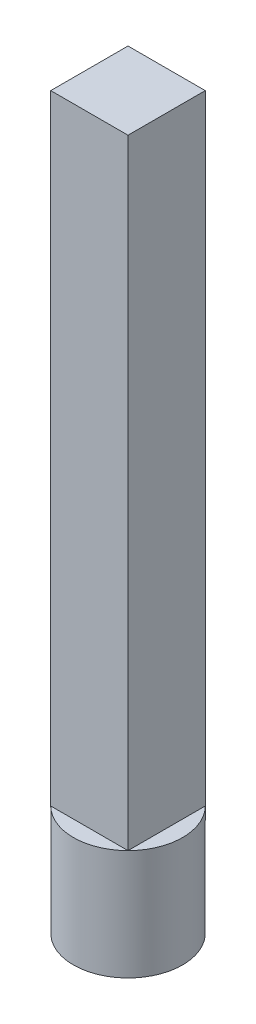
ISO-10303-21;
HEADER;
FILE_DESCRIPTION(('STEP AP214'),'2;1');
FILE_NAME('part.step','',(''),(''),'','','');
FILE_SCHEMA(('AUTOMOTIVE_DESIGN { 1 0 10303 214 1 1 1 1 }'));
ENDSEC;
DATA;
#1=APPLICATION_CONTEXT('core data for automotive mechanical design processes');
#2=APPLICATION_PROTOCOL_DEFINITION('international standard','automotive_design',2000,#1);
#3=PRODUCT_CONTEXT('',#1,'mechanical');
#4=PRODUCT('Part','Part','',(#3));
#5=PRODUCT_RELATED_PRODUCT_CATEGORY('part','',(#4));
#6=PRODUCT_DEFINITION_FORMATION('','',#4);
#7=PRODUCT_DEFINITION_CONTEXT('part definition',#1,'design');
#8=PRODUCT_DEFINITION('design','',#6,#7);
#9=PRODUCT_DEFINITION_SHAPE('','',#8);
#10=(LENGTH_UNIT() NAMED_UNIT(*) SI_UNIT(.MILLI.,.METRE.));
#11=(NAMED_UNIT(*) PLANE_ANGLE_UNIT() SI_UNIT($,.RADIAN.));
#12=(NAMED_UNIT(*) SI_UNIT($,.STERADIAN.) SOLID_ANGLE_UNIT());
#13=UNCERTAINTY_MEASURE_WITH_UNIT(LENGTH_MEASURE(1.E-05),#10,'distance_accuracy_value','');
#14=(GEOMETRIC_REPRESENTATION_CONTEXT(3) GLOBAL_UNCERTAINTY_ASSIGNED_CONTEXT((#13)) GLOBAL_UNIT_ASSIGNED_CONTEXT((#10,
#11,#12)) REPRESENTATION_CONTEXT('',''));
#15=CARTESIAN_POINT('',(0.,0.,0.));
#16=DIRECTION('',(0.,0.,1.));
#17=DIRECTION('',(1.,0.,0.));
#18=AXIS2_PLACEMENT_3D('',#15,#16,#17);
#19=CARTESIAN_POINT('',(0.,160.4,10.));
#20=DIRECTION('',(0.,0.,-1.));
#21=DIRECTION('',(-1.,0.,0.));
#22=AXIS2_PLACEMENT_3D('',#19,#20,#21);
#23=PLANE('',#22);
#24=DIRECTION('',(1.,0.,0.));
#25=VECTOR('',#24,1.);
#26=CARTESIAN_POINT('',(0.,0.,10.));
#27=LINE('',#26,#25);
#28=CARTESIAN_POINT('',(-9.99999999999999,0.,10.));
#29=VERTEX_POINT('',#28);
#30=CARTESIAN_POINT('',(10.,0.,10.));
#31=VERTEX_POINT('',#30);
#32=EDGE_CURVE('E92',#29,#31,#27,.T.);
#33=ORIENTED_EDGE('',*,*,#32,.T.);
#34=DIRECTION('',(0.,-1.,0.));
#35=VECTOR('',#34,1.);
#36=CARTESIAN_POINT('',(10.,160.4,10.));
#37=LINE('',#36,#35);
#38=CARTESIAN_POINT('',(10.,160.4,10.));
#39=VERTEX_POINT('',#38);
#40=EDGE_CURVE('E13',#39,#31,#37,.T.);
#41=ORIENTED_EDGE('',*,*,#40,.F.);
#42=DIRECTION('',(1.,0.,0.));
#43=VECTOR('',#42,1.);
#44=CARTESIAN_POINT('',(0.,160.4,10.));
#45=LINE('',#44,#43);
#46=CARTESIAN_POINT('',(-10.,160.4,10.));
#47=VERTEX_POINT('',#46);
#48=EDGE_CURVE('E124',#47,#39,#45,.T.);
#49=ORIENTED_EDGE('',*,*,#48,.F.);
#50=DIRECTION('',(0.,-1.,0.));
#51=VECTOR('',#50,1.);
#52=CARTESIAN_POINT('',(-10.,160.4,10.));
#53=LINE('',#52,#51);
#54=EDGE_CURVE('E61',#47,#29,#53,.T.);
#55=ORIENTED_EDGE('',*,*,#54,.T.);
#56=EDGE_LOOP('',(#33,#41,#49,#55));
#57=FACE_BOUND('',#56,.T.);
#58=ADVANCED_FACE('F46',(#57),#23,.F.);
#59=CARTESIAN_POINT('',(10.,160.4,0.));
#60=DIRECTION('',(-1.,0.,0.));
#61=DIRECTION('',(0.,0.,1.));
#62=AXIS2_PLACEMENT_3D('',#59,#60,#61);
#63=PLANE('',#62);
#64=DIRECTION('',(0.,0.,-1.));
#65=VECTOR('',#64,1.);
#66=CARTESIAN_POINT('',(10.,0.,0.));
#67=LINE('',#66,#65);
#68=CARTESIAN_POINT('',(10.,0.,-10.));
#69=VERTEX_POINT('',#68);
#70=EDGE_CURVE('E83',#31,#69,#67,.T.);
#71=ORIENTED_EDGE('',*,*,#70,.T.);
#72=DIRECTION('',(0.,-1.,0.));
#73=VECTOR('',#72,1.);
#74=CARTESIAN_POINT('',(10.,160.4,-10.));
#75=LINE('',#74,#73);
#76=CARTESIAN_POINT('',(10.,160.4,-10.));
#77=VERTEX_POINT('',#76);
#78=EDGE_CURVE('E54',#77,#69,#75,.T.);
#79=ORIENTED_EDGE('',*,*,#78,.F.);
#80=DIRECTION('',(0.,0.,-1.));
#81=VECTOR('',#80,1.);
#82=CARTESIAN_POINT('',(10.,160.4,0.));
#83=LINE('',#82,#81);
#84=EDGE_CURVE('E111',#39,#77,#83,.T.);
#85=ORIENTED_EDGE('',*,*,#84,.F.);
#86=ORIENTED_EDGE('',*,*,#40,.T.);
#87=EDGE_LOOP('',(#71,#79,#85,#86));
#88=FACE_BOUND('',#87,.T.);
#89=ADVANCED_FACE('F110',(#88),#63,.F.);
#90=CARTESIAN_POINT('',(0.,160.4,-10.));
#91=DIRECTION('',(0.,0.,-1.));
#92=DIRECTION('',(-1.,0.,0.));
#93=AXIS2_PLACEMENT_3D('',#90,#91,#92);
#94=PLANE('',#93);
#95=DIRECTION('',(1.,0.,0.));
#96=VECTOR('',#95,1.);
#97=CARTESIAN_POINT('',(0.,0.,-10.));
#98=LINE('',#97,#96);
#99=CARTESIAN_POINT('',(-10.,0.,-10.));
#100=VERTEX_POINT('',#99);
#101=EDGE_CURVE('E91',#100,#69,#98,.T.);
#102=ORIENTED_EDGE('',*,*,#101,.F.);
#103=DIRECTION('',(0.,-1.,0.));
#104=VECTOR('',#103,1.);
#105=CARTESIAN_POINT('',(-10.,160.4,-10.));
#106=LINE('',#105,#104);
#107=CARTESIAN_POINT('',(-10.,160.4,-10.));
#108=VERTEX_POINT('',#107);
#109=EDGE_CURVE('E126',#108,#100,#106,.T.);
#110=ORIENTED_EDGE('',*,*,#109,.F.);
#111=DIRECTION('',(1.,0.,0.));
#112=VECTOR('',#111,1.);
#113=CARTESIAN_POINT('',(0.,160.4,-10.));
#114=LINE('',#113,#112);
#115=EDGE_CURVE('E134',#108,#77,#114,.T.);
#116=ORIENTED_EDGE('',*,*,#115,.T.);
#117=ORIENTED_EDGE('',*,*,#78,.T.);
#118=EDGE_LOOP('',(#102,#110,#116,#117));
#119=FACE_BOUND('',#118,.T.);
#120=ADVANCED_FACE('F132',(#119),#94,.T.);
#121=CARTESIAN_POINT('',(-10.,160.4,0.));
#122=DIRECTION('',(-1.,0.,0.));
#123=DIRECTION('',(0.,0.,1.));
#124=AXIS2_PLACEMENT_3D('',#121,#122,#123);
#125=PLANE('',#124);
#126=DIRECTION('',(0.,0.,-1.));
#127=VECTOR('',#126,1.);
#128=CARTESIAN_POINT('',(-10.,0.,0.));
#129=LINE('',#128,#127);
#130=EDGE_CURVE('E122',#29,#100,#129,.T.);
#131=ORIENTED_EDGE('',*,*,#130,.F.);
#132=ORIENTED_EDGE('',*,*,#54,.F.);
#133=DIRECTION('',(0.,0.,-1.));
#134=VECTOR('',#133,1.);
#135=CARTESIAN_POINT('',(-10.,160.4,0.));
#136=LINE('',#135,#134);
#137=EDGE_CURVE('E118',#47,#108,#136,.T.);
#138=ORIENTED_EDGE('',*,*,#137,.T.);
#139=ORIENTED_EDGE('',*,*,#109,.T.);
#140=EDGE_LOOP('',(#131,#132,#138,#139));
#141=FACE_BOUND('',#140,.T.);
#142=ADVANCED_FACE('F140',(#141),#125,.T.);
#143=CARTESIAN_POINT('',(0.,160.4,0.));
#144=DIRECTION('',(0.,1.,0.));
#145=DIRECTION('',(0.,0.,1.));
#146=AXIS2_PLACEMENT_3D('',#143,#144,#145);
#147=PLANE('',#146);
#148=ORIENTED_EDGE('',*,*,#48,.T.);
#149=ORIENTED_EDGE('',*,*,#84,.T.);
#150=ORIENTED_EDGE('',*,*,#115,.F.);
#151=ORIENTED_EDGE('',*,*,#137,.F.);
#152=EDGE_LOOP('',(#148,#149,#150,#151));
#153=FACE_BOUND('',#152,.T.);
#154=ADVANCED_FACE('F139',(#153),#147,.T.);
#155=CARTESIAN_POINT('',(0.,0.,0.));
#156=DIRECTION('',(0.,1.,0.));
#157=DIRECTION('',(0.,0.,1.));
#158=AXIS2_PLACEMENT_3D('',#155,#156,#157);
#159=PLANE('',#158);
#160=CARTESIAN_POINT('',(0.,0.,0.));
#161=DIRECTION('',(0.,1.,0.));
#162=DIRECTION('',(0.,0.,1.));
#163=AXIS2_PLACEMENT_3D('',#160,#161,#162);
#164=CIRCLE('',#163,14.1421356237309);
#165=EDGE_CURVE('E102',#100,#29,#164,.T.);
#166=ORIENTED_EDGE('',*,*,#165,.T.);
#167=ORIENTED_EDGE('',*,*,#130,.T.);
#168=EDGE_LOOP('',(#166,#167));
#169=FACE_BOUND('',#168,.T.);
#170=ADVANCED_FACE('F142',(#169),#159,.T.);
#171=EDGE_CURVE('E106',#69,#100,#164,.T.);
#172=ORIENTED_EDGE('',*,*,#171,.T.);
#173=ORIENTED_EDGE('',*,*,#101,.T.);
#174=EDGE_LOOP('',(#172,#173));
#175=FACE_BOUND('',#174,.T.);
#176=ADVANCED_FACE('F144',(#175),#159,.T.);
#177=ORIENTED_EDGE('',*,*,#32,.F.);
#178=EDGE_CURVE('E96',#29,#31,#164,.T.);
#179=ORIENTED_EDGE('',*,*,#178,.T.);
#180=EDGE_LOOP('',(#177,#179));
#181=FACE_BOUND('',#180,.T.);
#182=ADVANCED_FACE('F97',(#181),#159,.T.);
#183=CARTESIAN_POINT('',(0.,-28.575,0.));
#184=DIRECTION('',(0.,1.,0.));
#185=DIRECTION('',(0.,0.,1.));
#186=AXIS2_PLACEMENT_3D('',#183,#184,#185);
#187=CYLINDRICAL_SURFACE('',#186,14.1421356237309);
#188=CARTESIAN_POINT('',(0.,-28.575,0.));
#189=DIRECTION('',(0.,1.,0.));
#190=DIRECTION('',(0.,0.,1.));
#191=AXIS2_PLACEMENT_3D('',#188,#189,#190);
#192=CIRCLE('',#191,14.1421356237309);
#193=CARTESIAN_POINT('',(0.,-28.575,14.1421356237309));
#194=VERTEX_POINT('',#193);
#195=EDGE_CURVE('E108',#194,#194,#192,.T.);
#196=ORIENTED_EDGE('',*,*,#195,.T.);
#197=EDGE_LOOP('',(#196));
#198=FACE_BOUND('',#197,.T.);
#199=EDGE_CURVE('E87',#31,#69,#164,.T.);
#200=ORIENTED_EDGE('',*,*,#199,.F.);
#201=ORIENTED_EDGE('',*,*,#178,.F.);
#202=ORIENTED_EDGE('',*,*,#165,.F.);
#203=ORIENTED_EDGE('',*,*,#171,.F.);
#204=EDGE_LOOP('',(#200,#201,#202,#203));
#205=FACE_BOUND('',#204,.T.);
#206=ADVANCED_FACE('F104',(#198,#205),#187,.T.);
#207=CARTESIAN_POINT('',(0.,-28.575,0.));
#208=DIRECTION('',(0.,1.,0.));
#209=DIRECTION('',(0.,0.,1.));
#210=AXIS2_PLACEMENT_3D('',#207,#208,#209);
#211=PLANE('',#210);
#212=ORIENTED_EDGE('',*,*,#195,.F.);
#213=EDGE_LOOP('',(#212));
#214=FACE_BOUND('',#213,.T.);
#215=ADVANCED_FACE('F166',(#214),#211,.F.);
#216=ORIENTED_EDGE('',*,*,#70,.F.);
#217=ORIENTED_EDGE('',*,*,#199,.T.);
#218=EDGE_LOOP('',(#216,#217));
#219=FACE_BOUND('',#218,.T.);
#220=ADVANCED_FACE('F85',(#219),#159,.T.);
#221=CLOSED_SHELL('',(#58,#89,#120,#142,#154,#170,#176,#182,#206,#215,#220));
#222=MANIFOLD_SOLID_BREP('B2',#221);
#223=ADVANCED_BREP_SHAPE_REPRESENTATION('',(#18,#222),#14);
#224=SHAPE_DEFINITION_REPRESENTATION(#9,#223);
ENDSEC;
END-ISO-10303-21;
